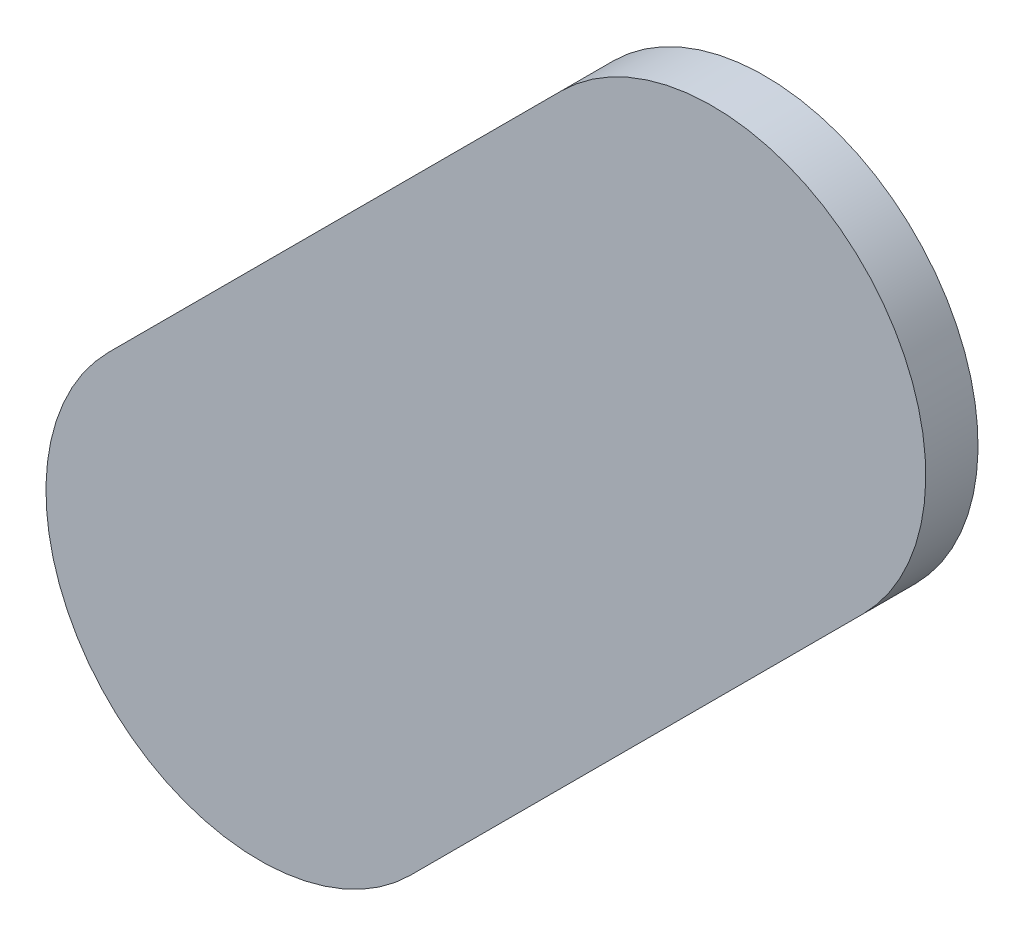
ISO-10303-21;
HEADER;
FILE_DESCRIPTION(('STEP AP214'),'2;1');
FILE_NAME('part.step','',(''),(''),'','','');
FILE_SCHEMA(('AUTOMOTIVE_DESIGN { 1 0 10303 214 1 1 1 1 }'));
ENDSEC;
DATA;
#1=APPLICATION_CONTEXT('core data for automotive mechanical design processes');
#2=APPLICATION_PROTOCOL_DEFINITION('international standard','automotive_design',2000,#1);
#3=PRODUCT_CONTEXT('',#1,'mechanical');
#4=PRODUCT('Part','Part','',(#3));
#5=PRODUCT_RELATED_PRODUCT_CATEGORY('part','',(#4));
#6=PRODUCT_DEFINITION_FORMATION('','',#4);
#7=PRODUCT_DEFINITION_CONTEXT('part definition',#1,'design');
#8=PRODUCT_DEFINITION('design','',#6,#7);
#9=PRODUCT_DEFINITION_SHAPE('','',#8);
#10=(LENGTH_UNIT() NAMED_UNIT(*) SI_UNIT(.MILLI.,.METRE.));
#11=(NAMED_UNIT(*) PLANE_ANGLE_UNIT() SI_UNIT($,.RADIAN.));
#12=(NAMED_UNIT(*) SI_UNIT($,.STERADIAN.) SOLID_ANGLE_UNIT());
#13=UNCERTAINTY_MEASURE_WITH_UNIT(LENGTH_MEASURE(1.E-05),#10,'distance_accuracy_value','');
#14=(GEOMETRIC_REPRESENTATION_CONTEXT(3) GLOBAL_UNCERTAINTY_ASSIGNED_CONTEXT((#13)) GLOBAL_UNIT_ASSIGNED_CONTEXT((#10,
#11,#12)) REPRESENTATION_CONTEXT('',''));
#15=CARTESIAN_POINT('',(0.,0.,0.));
#16=DIRECTION('',(0.,0.,1.));
#17=DIRECTION('',(1.,0.,0.));
#18=AXIS2_PLACEMENT_3D('',#15,#16,#17);
#19=CARTESIAN_POINT('',(6.83730475598,6.970857978031,0.79916));
#20=DIRECTION('',(0.,0.,1.));
#21=DIRECTION('',(1.,0.,0.));
#22=AXIS2_PLACEMENT_3D('',#19,#20,#21);
#23=PLANE('',#22);
#24=CARTESIAN_POINT('',(6.688812,6.822365333,0.79916));
#25=DIRECTION('',(0.,0.,1.));
#26=DIRECTION('',(1.,0.,0.));
#27=AXIS2_PLACEMENT_3D('',#24,#25,#26);
#28=CIRCLE('',#27,0.139999667);
#29=CARTESIAN_POINT('',(6.78780731612217,6.72337065012202,0.79916));
#30=VERTEX_POINT('',#29);
#31=CARTESIAN_POINT('',(6.58981740516727,6.92136016596486,0.79916));
#32=VERTEX_POINT('',#31);
#33=EDGE_CURVE('E20',#30,#32,#28,.F.);
#34=ORIENTED_EDGE('',*,*,#33,.F.);
#35=DIRECTION('',(-0.707106660628037,-0.707106901745037,0.));
#36=VECTOR('',#35,1.);
#37=CARTESIAN_POINT('',(7.084791948866,7.020355384135,0.79916));
#38=LINE('',#37,#36);
#39=CARTESIAN_POINT('',(7.08479212405482,7.02035555932387,0.79916));
#40=VERTEX_POINT('',#39);
#41=EDGE_CURVE('E65',#30,#40,#38,.F.);
#42=ORIENTED_EDGE('',*,*,#41,.T.);
#43=CARTESIAN_POINT('',(6.985797,7.119350434268,0.79916));
#44=DIRECTION('',(0.,0.,1.));
#45=DIRECTION('',(1.,0.,0.));
#46=AXIS2_PLACEMENT_3D('',#43,#44,#45);
#47=CIRCLE('',#46,0.14);
#48=CARTESIAN_POINT('',(6.88680197763338,7.21834531063353,0.79916));
#49=VERTEX_POINT('',#48);
#50=EDGE_CURVE('E57',#49,#40,#47,.F.);
#51=ORIENTED_EDGE('',*,*,#50,.F.);
#52=DIRECTION('',(0.707106099992719,0.707107462379719,0.));
#53=VECTOR('',#52,1.);
#54=CARTESIAN_POINT('',(6.5898176196,6.921360380398,0.79916));
#55=LINE('',#54,#53);
#56=EDGE_CURVE('E64',#49,#32,#55,.F.);
#57=ORIENTED_EDGE('',*,*,#56,.T.);
#58=EDGE_LOOP('',(#34,#42,#51,#57));
#59=FACE_BOUND('',#58,.T.);
#60=ADVANCED_FACE('F17',(#59),#23,.T.);
#61=CARTESIAN_POINT('',(7.084791948866,7.020355384135,0.76487));
#62=DIRECTION('',(-0.707106901745037,0.707106660628037,0.));
#63=DIRECTION('',(-0.707106660628037,-0.707106901745037,0.));
#64=AXIS2_PLACEMENT_3D('',#61,#62,#63);
#65=PLANE('',#64);
#66=DIRECTION('',(0.,0.,1.));
#67=VECTOR('',#66,1.);
#68=CARTESIAN_POINT('',(6.7878073330001,6.7233706669999,0.76487));
#69=LINE('',#68,#67);
#70=CARTESIAN_POINT('',(6.78780731612214,6.72337065012203,0.76487));
#71=VERTEX_POINT('',#70);
#72=EDGE_CURVE('E68',#71,#30,#69,.T.);
#73=ORIENTED_EDGE('',*,*,#72,.F.);
#74=DIRECTION('',(-0.707106660628132,-0.707106901744942,0.));
#75=VECTOR('',#74,1.);
#76=CARTESIAN_POINT('',(7.084791948866,7.020355384135,0.76487));
#77=LINE('',#76,#75);
#78=CARTESIAN_POINT('',(7.08479212405481,7.02035555932387,0.76487));
#79=VERTEX_POINT('',#78);
#80=EDGE_CURVE('E72',#79,#71,#77,.T.);
#81=ORIENTED_EDGE('',*,*,#80,.F.);
#82=DIRECTION('',(0.,0.,1.));
#83=VECTOR('',#82,1.);
#84=CARTESIAN_POINT('',(7.084791948866,7.020355384135,0.76487));
#85=LINE('',#84,#83);
#86=EDGE_CURVE('E60',#40,#79,#85,.F.);
#87=ORIENTED_EDGE('',*,*,#86,.F.);
#88=ORIENTED_EDGE('',*,*,#41,.F.);
#89=EDGE_LOOP('',(#73,#81,#87,#88));
#90=FACE_BOUND('',#89,.T.);
#91=ADVANCED_FACE('F70',(#90),#65,.F.);
#92=CARTESIAN_POINT('',(6.688812,6.822365333,0.76487));
#93=DIRECTION('',(0.,0.,1.));
#94=DIRECTION('',(1.,0.,0.));
#95=AXIS2_PLACEMENT_3D('',#92,#93,#94);
#96=CYLINDRICAL_SURFACE('',#95,0.139999667);
#97=DIRECTION('',(0.,0.,1.));
#98=VECTOR('',#97,1.);
#99=CARTESIAN_POINT('',(6.5898176196,6.921360380398,0.76487));
#100=LINE('',#99,#98);
#101=CARTESIAN_POINT('',(6.58981740516729,6.92136016596488,0.76487));
#102=VERTEX_POINT('',#101);
#103=EDGE_CURVE('E77',#32,#102,#100,.F.);
#104=ORIENTED_EDGE('',*,*,#103,.T.);
#105=CARTESIAN_POINT('',(6.688812333,6.822365565732,0.76487));
#106=DIRECTION('',(0.,0.,1.));
#107=DIRECTION('',(1.,0.,0.));
#108=AXIS2_PLACEMENT_3D('',#105,#106,#107);
#109=CIRCLE('',#108,0.14);
#110=EDGE_CURVE('E26',#71,#102,#109,.F.);
#111=ORIENTED_EDGE('',*,*,#110,.F.);
#112=ORIENTED_EDGE('',*,*,#72,.T.);
#113=ORIENTED_EDGE('',*,*,#33,.T.);
#114=EDGE_LOOP('',(#104,#111,#112,#113));
#115=FACE_BOUND('',#114,.T.);
#116=ADVANCED_FACE('F88',(#115),#96,.T.);
#117=CARTESIAN_POINT('',(6.5898176196,6.921360380398,0.76487));
#118=DIRECTION('',(0.707107462379719,-0.707106099992719,0.));
#119=DIRECTION('',(0.707106099992719,0.707107462379719,0.));
#120=AXIS2_PLACEMENT_3D('',#117,#118,#119);
#121=PLANE('',#120);
#122=DIRECTION('',(0.,0.,1.));
#123=VECTOR('',#122,1.);
#124=CARTESIAN_POINT('',(6.8868019999999,7.2183453330001,0.76487));
#125=LINE('',#124,#123);
#126=CARTESIAN_POINT('',(6.88680197763347,7.21834531063347,0.76487));
#127=VERTEX_POINT('',#126);
#128=EDGE_CURVE('E62',#127,#49,#125,.T.);
#129=ORIENTED_EDGE('',*,*,#128,.F.);
#130=DIRECTION('',(0.707106099992945,0.707107462379493,0.));
#131=VECTOR('',#130,1.);
#132=CARTESIAN_POINT('',(6.5898176196,6.921360380398,0.76487));
#133=LINE('',#132,#131);
#134=EDGE_CURVE('E11',#102,#127,#133,.T.);
#135=ORIENTED_EDGE('',*,*,#134,.F.);
#136=ORIENTED_EDGE('',*,*,#103,.F.);
#137=ORIENTED_EDGE('',*,*,#56,.F.);
#138=EDGE_LOOP('',(#129,#135,#136,#137));
#139=FACE_BOUND('',#138,.T.);
#140=ADVANCED_FACE('F96',(#139),#121,.F.);
#141=CARTESIAN_POINT('',(6.985797,7.119350434268,0.76487));
#142=DIRECTION('',(0.,0.,1.));
#143=DIRECTION('',(1.,0.,0.));
#144=AXIS2_PLACEMENT_3D('',#141,#142,#143);
#145=CYLINDRICAL_SURFACE('',#144,0.14);
#146=CARTESIAN_POINT('',(6.985797333,7.119350667,0.76487));
#147=DIRECTION('',(0.,0.,1.));
#148=DIRECTION('',(1.,0.,0.));
#149=AXIS2_PLACEMENT_3D('',#146,#147,#148);
#150=CIRCLE('',#149,0.14);
#151=EDGE_CURVE('E35',#127,#79,#150,.F.);
#152=ORIENTED_EDGE('',*,*,#151,.F.);
#153=ORIENTED_EDGE('',*,*,#128,.T.);
#154=ORIENTED_EDGE('',*,*,#50,.T.);
#155=ORIENTED_EDGE('',*,*,#86,.T.);
#156=EDGE_LOOP('',(#152,#153,#154,#155));
#157=FACE_BOUND('',#156,.T.);
#158=ADVANCED_FACE('F58',(#157),#145,.T.);
#159=CARTESIAN_POINT('',(6.83730475598,6.970857978031,0.76487));
#160=DIRECTION('',(0.,0.,-1.));
#161=DIRECTION('',(-1.,0.,0.));
#162=AXIS2_PLACEMENT_3D('',#159,#160,#161);
#163=PLANE('',#162);
#164=ORIENTED_EDGE('',*,*,#134,.T.);
#165=ORIENTED_EDGE('',*,*,#151,.T.);
#166=ORIENTED_EDGE('',*,*,#80,.T.);
#167=ORIENTED_EDGE('',*,*,#110,.T.);
#168=EDGE_LOOP('',(#164,#165,#166,#167));
#169=FACE_BOUND('',#168,.T.);
#170=ADVANCED_FACE('F89',(#169),#163,.T.);
#171=CLOSED_SHELL('',(#60,#91,#116,#140,#158,#170));
#172=MANIFOLD_SOLID_BREP('B1',#171);
#173=ADVANCED_BREP_SHAPE_REPRESENTATION('',(#18,#172),#14);
#174=SHAPE_DEFINITION_REPRESENTATION(#9,#173);
ENDSEC;
END-ISO-10303-21;
